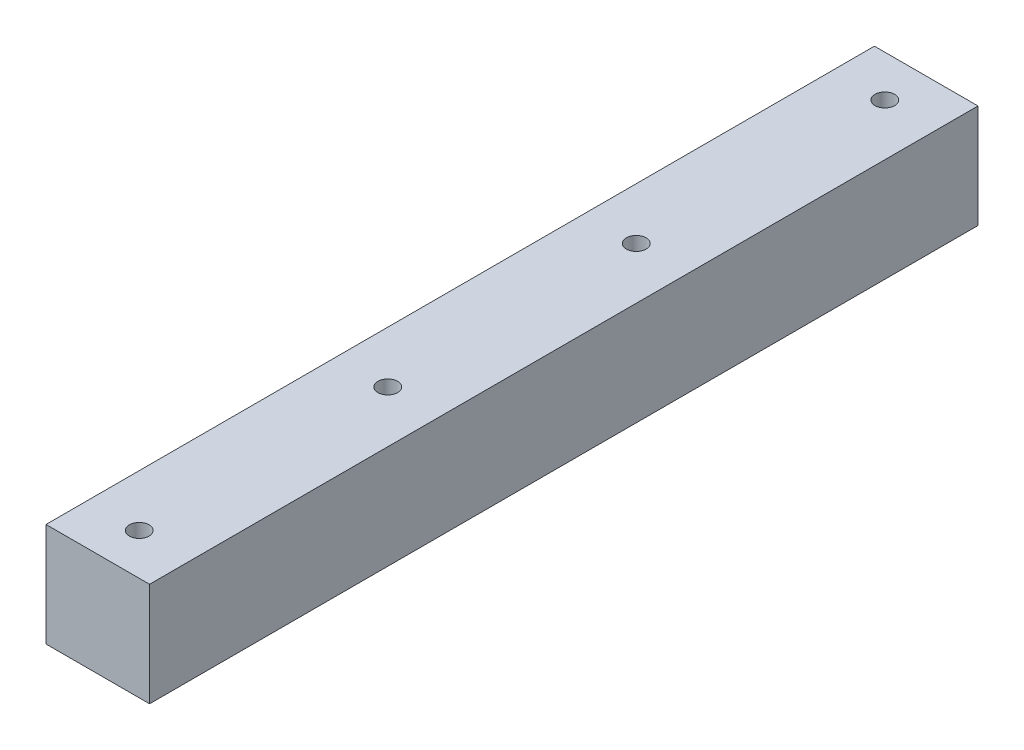
ISO-10303-21;
HEADER;
FILE_DESCRIPTION(('STEP AP214'),'2;1');
FILE_NAME('part.step','',(''),(''),'','','');
FILE_SCHEMA(('AUTOMOTIVE_DESIGN { 1 0 10303 214 1 1 1 1 }'));
ENDSEC;
DATA;
#1=APPLICATION_CONTEXT('core data for automotive mechanical design processes');
#2=APPLICATION_PROTOCOL_DEFINITION('international standard','automotive_design',2000,#1);
#3=PRODUCT_CONTEXT('',#1,'mechanical');
#4=PRODUCT('Part','Part','',(#3));
#5=PRODUCT_RELATED_PRODUCT_CATEGORY('part','',(#4));
#6=PRODUCT_DEFINITION_FORMATION('','',#4);
#7=PRODUCT_DEFINITION_CONTEXT('part definition',#1,'design');
#8=PRODUCT_DEFINITION('design','',#6,#7);
#9=PRODUCT_DEFINITION_SHAPE('','',#8);
#10=(LENGTH_UNIT() NAMED_UNIT(*) SI_UNIT(.MILLI.,.METRE.));
#11=(NAMED_UNIT(*) PLANE_ANGLE_UNIT() SI_UNIT($,.RADIAN.));
#12=(NAMED_UNIT(*) SI_UNIT($,.STERADIAN.) SOLID_ANGLE_UNIT());
#13=UNCERTAINTY_MEASURE_WITH_UNIT(LENGTH_MEASURE(1.E-05),#10,'distance_accuracy_value','');
#14=(GEOMETRIC_REPRESENTATION_CONTEXT(3) GLOBAL_UNCERTAINTY_ASSIGNED_CONTEXT((#13)) GLOBAL_UNIT_ASSIGNED_CONTEXT((#10,
#11,#12)) REPRESENTATION_CONTEXT('',''));
#15=CARTESIAN_POINT('',(0.,0.,0.));
#16=DIRECTION('',(0.,0.,1.));
#17=DIRECTION('',(1.,0.,0.));
#18=AXIS2_PLACEMENT_3D('',#15,#16,#17);
#19=CARTESIAN_POINT('',(25.,50.,200.));
#20=DIRECTION('',(-1.,0.,0.));
#21=DIRECTION('',(0.,0.,1.));
#22=AXIS2_PLACEMENT_3D('',#19,#20,#21);
#23=PLANE('',#22);
#24=DIRECTION('',(0.,0.,-1.));
#25=VECTOR('',#24,1.);
#26=CARTESIAN_POINT('',(25.,0.,200.));
#27=LINE('',#26,#25);
#28=CARTESIAN_POINT('',(25.,0.,200.));
#29=VERTEX_POINT('',#28);
#30=CARTESIAN_POINT('',(25.,0.,-200.));
#31=VERTEX_POINT('',#30);
#32=EDGE_CURVE('E101',#29,#31,#27,.T.);
#33=ORIENTED_EDGE('',*,*,#32,.T.);
#34=DIRECTION('',(0.,-1.,0.));
#35=VECTOR('',#34,1.);
#36=CARTESIAN_POINT('',(25.,50.,-200.));
#37=LINE('',#36,#35);
#38=CARTESIAN_POINT('',(25.,50.,-200.));
#39=VERTEX_POINT('',#38);
#40=EDGE_CURVE('E128',#39,#31,#37,.T.);
#41=ORIENTED_EDGE('',*,*,#40,.F.);
#42=DIRECTION('',(0.,0.,-1.));
#43=VECTOR('',#42,1.);
#44=CARTESIAN_POINT('',(25.,50.,200.));
#45=LINE('',#44,#43);
#46=CARTESIAN_POINT('',(25.,50.,200.));
#47=VERTEX_POINT('',#46);
#48=EDGE_CURVE('E102',#47,#39,#45,.T.);
#49=ORIENTED_EDGE('',*,*,#48,.F.);
#50=DIRECTION('',(0.,-1.,0.));
#51=VECTOR('',#50,1.);
#52=CARTESIAN_POINT('',(25.,50.,200.));
#53=LINE('',#52,#51);
#54=EDGE_CURVE('E112',#47,#29,#53,.T.);
#55=ORIENTED_EDGE('',*,*,#54,.T.);
#56=EDGE_LOOP('',(#33,#41,#49,#55));
#57=FACE_BOUND('',#56,.T.);
#58=ADVANCED_FACE('F35',(#57),#23,.F.);
#59=CARTESIAN_POINT('',(-25.,50.,-200.));
#60=DIRECTION('',(0.,0.,1.));
#61=DIRECTION('',(1.,0.,0.));
#62=AXIS2_PLACEMENT_3D('',#59,#60,#61);
#63=PLANE('',#62);
#64=DIRECTION('',(-1.,0.,0.));
#65=VECTOR('',#64,1.);
#66=CARTESIAN_POINT('',(-25.,0.,-200.));
#67=LINE('',#66,#65);
#68=CARTESIAN_POINT('',(-25.,0.,-200.));
#69=VERTEX_POINT('',#68);
#70=EDGE_CURVE('E115',#31,#69,#67,.T.);
#71=ORIENTED_EDGE('',*,*,#70,.T.);
#72=DIRECTION('',(0.,-1.,0.));
#73=VECTOR('',#72,1.);
#74=CARTESIAN_POINT('',(-25.,50.,-200.));
#75=LINE('',#74,#73);
#76=CARTESIAN_POINT('',(-25.,50.,-200.));
#77=VERTEX_POINT('',#76);
#78=EDGE_CURVE('E125',#77,#69,#75,.T.);
#79=ORIENTED_EDGE('',*,*,#78,.F.);
#80=DIRECTION('',(-1.,0.,0.));
#81=VECTOR('',#80,1.);
#82=CARTESIAN_POINT('',(-25.,50.,-200.));
#83=LINE('',#82,#81);
#84=EDGE_CURVE('E105',#39,#77,#83,.T.);
#85=ORIENTED_EDGE('',*,*,#84,.F.);
#86=ORIENTED_EDGE('',*,*,#40,.T.);
#87=EDGE_LOOP('',(#71,#79,#85,#86));
#88=FACE_BOUND('',#87,.T.);
#89=ADVANCED_FACE('F160',(#88),#63,.F.);
#90=CARTESIAN_POINT('',(-25.,50.,200.));
#91=DIRECTION('',(1.,0.,0.));
#92=DIRECTION('',(0.,0.,-1.));
#93=AXIS2_PLACEMENT_3D('',#90,#91,#92);
#94=PLANE('',#93);
#95=DIRECTION('',(0.,0.,1.));
#96=VECTOR('',#95,1.);
#97=CARTESIAN_POINT('',(-25.,0.,200.));
#98=LINE('',#97,#96);
#99=CARTESIAN_POINT('',(-25.,0.,200.));
#100=VERTEX_POINT('',#99);
#101=EDGE_CURVE('E117',#69,#100,#98,.T.);
#102=ORIENTED_EDGE('',*,*,#101,.T.);
#103=DIRECTION('',(0.,-1.,0.));
#104=VECTOR('',#103,1.);
#105=CARTESIAN_POINT('',(-25.,50.,200.));
#106=LINE('',#105,#104);
#107=CARTESIAN_POINT('',(-25.,50.,200.));
#108=VERTEX_POINT('',#107);
#109=EDGE_CURVE('E122',#108,#100,#106,.T.);
#110=ORIENTED_EDGE('',*,*,#109,.F.);
#111=DIRECTION('',(0.,0.,1.));
#112=VECTOR('',#111,1.);
#113=CARTESIAN_POINT('',(-25.,50.,200.));
#114=LINE('',#113,#112);
#115=EDGE_CURVE('E108',#77,#108,#114,.T.);
#116=ORIENTED_EDGE('',*,*,#115,.F.);
#117=ORIENTED_EDGE('',*,*,#78,.T.);
#118=EDGE_LOOP('',(#102,#110,#116,#117));
#119=FACE_BOUND('',#118,.T.);
#120=ADVANCED_FACE('F153',(#119),#94,.F.);
#121=CARTESIAN_POINT('',(-25.,50.,200.));
#122=DIRECTION('',(0.,0.,-1.));
#123=DIRECTION('',(-1.,0.,0.));
#124=AXIS2_PLACEMENT_3D('',#121,#122,#123);
#125=PLANE('',#124);
#126=DIRECTION('',(1.,0.,0.));
#127=VECTOR('',#126,1.);
#128=CARTESIAN_POINT('',(-25.,0.,200.));
#129=LINE('',#128,#127);
#130=EDGE_CURVE('E106',#100,#29,#129,.T.);
#131=ORIENTED_EDGE('',*,*,#130,.T.);
#132=ORIENTED_EDGE('',*,*,#54,.F.);
#133=DIRECTION('',(1.,0.,0.));
#134=VECTOR('',#133,1.);
#135=CARTESIAN_POINT('',(-25.,50.,200.));
#136=LINE('',#135,#134);
#137=EDGE_CURVE('E110',#108,#47,#136,.T.);
#138=ORIENTED_EDGE('',*,*,#137,.F.);
#139=ORIENTED_EDGE('',*,*,#109,.T.);
#140=EDGE_LOOP('',(#131,#132,#138,#139));
#141=FACE_BOUND('',#140,.T.);
#142=ADVANCED_FACE('F143',(#141),#125,.F.);
#143=CARTESIAN_POINT('',(0.,50.,0.));
#144=DIRECTION('',(0.,-1.,0.));
#145=DIRECTION('',(0.,0.,-1.));
#146=AXIS2_PLACEMENT_3D('',#143,#144,#145);
#147=PLANE('',#146);
#148=CARTESIAN_POINT('',(0.,50.,59.9999999999999));
#149=DIRECTION('',(0.,1.,0.));
#150=DIRECTION('',(0.,0.,1.));
#151=AXIS2_PLACEMENT_3D('',#148,#149,#150);
#152=CIRCLE('',#151,4.75);
#153=CARTESIAN_POINT('',(0.,50.,64.7499999999999));
#154=VERTEX_POINT('',#153);
#155=EDGE_CURVE('E91',#154,#154,#152,.T.);
#156=ORIENTED_EDGE('',*,*,#155,.F.);
#157=EDGE_LOOP('',(#156));
#158=FACE_BOUND('',#157,.T.);
#159=CARTESIAN_POINT('',(0.,50.,180.));
#160=DIRECTION('',(0.,1.,0.));
#161=DIRECTION('',(0.,0.,1.));
#162=AXIS2_PLACEMENT_3D('',#159,#160,#161);
#163=CIRCLE('',#162,4.75);
#164=CARTESIAN_POINT('',(0.,50.,184.75));
#165=VERTEX_POINT('',#164);
#166=EDGE_CURVE('E90',#165,#165,#163,.T.);
#167=ORIENTED_EDGE('',*,*,#166,.F.);
#168=EDGE_LOOP('',(#167));
#169=FACE_BOUND('',#168,.T.);
#170=ORIENTED_EDGE('',*,*,#48,.T.);
#171=ORIENTED_EDGE('',*,*,#84,.T.);
#172=ORIENTED_EDGE('',*,*,#115,.T.);
#173=ORIENTED_EDGE('',*,*,#137,.T.);
#174=EDGE_LOOP('',(#170,#171,#172,#173));
#175=FACE_BOUND('',#174,.T.);
#176=CARTESIAN_POINT('',(0.,50.,-60.0000000000001));
#177=DIRECTION('',(0.,1.,0.));
#178=DIRECTION('',(0.,0.,1.));
#179=AXIS2_PLACEMENT_3D('',#176,#177,#178);
#180=CIRCLE('',#179,4.75);
#181=CARTESIAN_POINT('',(0.,50.,-55.2500000000001));
#182=VERTEX_POINT('',#181);
#183=EDGE_CURVE('E131',#182,#182,#180,.T.);
#184=ORIENTED_EDGE('',*,*,#183,.F.);
#185=EDGE_LOOP('',(#184));
#186=FACE_BOUND('',#185,.T.);
#187=CARTESIAN_POINT('',(0.,50.,-180.));
#188=DIRECTION('',(0.,1.,0.));
#189=DIRECTION('',(0.,0.,1.));
#190=AXIS2_PLACEMENT_3D('',#187,#188,#189);
#191=CIRCLE('',#190,4.75);
#192=CARTESIAN_POINT('',(0.,50.,-175.25));
#193=VERTEX_POINT('',#192);
#194=EDGE_CURVE('E43',#193,#193,#191,.T.);
#195=ORIENTED_EDGE('',*,*,#194,.F.);
#196=EDGE_LOOP('',(#195));
#197=FACE_BOUND('',#196,.T.);
#198=ADVANCED_FACE('F140',(#158,#169,#175,#186,#197),#147,.F.);
#199=CARTESIAN_POINT('',(0.,0.,0.));
#200=DIRECTION('',(0.,-1.,0.));
#201=DIRECTION('',(0.,0.,-1.));
#202=AXIS2_PLACEMENT_3D('',#199,#200,#201);
#203=PLANE('',#202);
#204=ORIENTED_EDGE('',*,*,#32,.F.);
#205=ORIENTED_EDGE('',*,*,#130,.F.);
#206=ORIENTED_EDGE('',*,*,#101,.F.);
#207=ORIENTED_EDGE('',*,*,#70,.F.);
#208=EDGE_LOOP('',(#204,#205,#206,#207));
#209=FACE_BOUND('',#208,.T.);
#210=ADVANCED_FACE('F142',(#209),#203,.T.);
#211=CARTESIAN_POINT('',(0.,30.,180.));
#212=DIRECTION('',(0.,1.,0.));
#213=DIRECTION('',(0.,0.,1.));
#214=AXIS2_PLACEMENT_3D('',#211,#212,#213);
#215=CONICAL_SURFACE('',#214,4.75,1.02974425867665);
#216=CARTESIAN_POINT('',(0.,27.1459120596191,180.));
#217=VERTEX_POINT('',#216);
#218=VERTEX_LOOP('',#217);
#219=FACE_BOUND('',#218,.T.);
#220=CARTESIAN_POINT('',(0.,30.,180.));
#221=DIRECTION('',(0.,1.,0.));
#222=DIRECTION('',(0.,0.,1.));
#223=AXIS2_PLACEMENT_3D('',#220,#221,#222);
#224=CIRCLE('',#223,4.75);
#225=CARTESIAN_POINT('',(0.,30.,184.75));
#226=VERTEX_POINT('',#225);
#227=EDGE_CURVE('E94',#226,#226,#224,.T.);
#228=ORIENTED_EDGE('',*,*,#227,.T.);
#229=EDGE_LOOP('',(#228));
#230=FACE_BOUND('',#229,.T.);
#231=ADVANCED_FACE('F150',(#219,#230),#215,.F.);
#232=CARTESIAN_POINT('',(0.,50.,180.));
#233=DIRECTION('',(0.,1.,0.));
#234=DIRECTION('',(0.,0.,1.));
#235=AXIS2_PLACEMENT_3D('',#232,#233,#234);
#236=CYLINDRICAL_SURFACE('',#235,4.75);
#237=ORIENTED_EDGE('',*,*,#227,.F.);
#238=EDGE_LOOP('',(#237));
#239=FACE_BOUND('',#238,.T.);
#240=ORIENTED_EDGE('',*,*,#166,.T.);
#241=EDGE_LOOP('',(#240));
#242=FACE_BOUND('',#241,.T.);
#243=ADVANCED_FACE('F84',(#239,#242),#236,.F.);
#244=CARTESIAN_POINT('',(0.,30.,59.9999999999999));
#245=DIRECTION('',(0.,1.,0.));
#246=DIRECTION('',(0.,0.,1.));
#247=AXIS2_PLACEMENT_3D('',#244,#245,#246);
#248=CONICAL_SURFACE('',#247,4.75,1.02974425867665);
#249=CARTESIAN_POINT('',(0.,27.1459120596191,59.9999999999999));
#250=VERTEX_POINT('',#249);
#251=VERTEX_LOOP('',#250);
#252=FACE_BOUND('',#251,.T.);
#253=CARTESIAN_POINT('',(0.,30.,59.9999999999999));
#254=DIRECTION('',(0.,1.,0.));
#255=DIRECTION('',(0.,0.,1.));
#256=AXIS2_PLACEMENT_3D('',#253,#254,#255);
#257=CIRCLE('',#256,4.75);
#258=CARTESIAN_POINT('',(0.,30.,64.7499999999999));
#259=VERTEX_POINT('',#258);
#260=EDGE_CURVE('E88',#259,#259,#257,.T.);
#261=ORIENTED_EDGE('',*,*,#260,.T.);
#262=EDGE_LOOP('',(#261));
#263=FACE_BOUND('',#262,.T.);
#264=ADVANCED_FACE('F80',(#252,#263),#248,.F.);
#265=CARTESIAN_POINT('',(0.,50.,59.9999999999999));
#266=DIRECTION('',(0.,1.,0.));
#267=DIRECTION('',(0.,0.,1.));
#268=AXIS2_PLACEMENT_3D('',#265,#266,#267);
#269=CYLINDRICAL_SURFACE('',#268,4.75);
#270=ORIENTED_EDGE('',*,*,#260,.F.);
#271=EDGE_LOOP('',(#270));
#272=FACE_BOUND('',#271,.T.);
#273=ORIENTED_EDGE('',*,*,#155,.T.);
#274=EDGE_LOOP('',(#273));
#275=FACE_BOUND('',#274,.T.);
#276=ADVANCED_FACE('F83',(#272,#275),#269,.F.);
#277=CARTESIAN_POINT('',(0.,50.,-60.0000000000001));
#278=DIRECTION('',(0.,1.,0.));
#279=DIRECTION('',(0.,0.,1.));
#280=AXIS2_PLACEMENT_3D('',#277,#278,#279);
#281=CYLINDRICAL_SURFACE('',#280,4.75);
#282=CARTESIAN_POINT('',(0.,30.,-60.0000000000001));
#283=DIRECTION('',(0.,1.,0.));
#284=DIRECTION('',(0.,0.,1.));
#285=AXIS2_PLACEMENT_3D('',#282,#283,#284);
#286=CIRCLE('',#285,4.75);
#287=CARTESIAN_POINT('',(0.,30.,-55.2500000000001));
#288=VERTEX_POINT('',#287);
#289=EDGE_CURVE('E134',#288,#288,#286,.T.);
#290=ORIENTED_EDGE('',*,*,#289,.F.);
#291=EDGE_LOOP('',(#290));
#292=FACE_BOUND('',#291,.T.);
#293=ORIENTED_EDGE('',*,*,#183,.T.);
#294=EDGE_LOOP('',(#293));
#295=FACE_BOUND('',#294,.T.);
#296=ADVANCED_FACE('F173',(#292,#295),#281,.F.);
#297=CARTESIAN_POINT('',(0.,30.,-60.0000000000001));
#298=DIRECTION('',(0.,1.,0.));
#299=DIRECTION('',(0.,0.,1.));
#300=AXIS2_PLACEMENT_3D('',#297,#298,#299);
#301=CONICAL_SURFACE('',#300,4.75,1.02974425867665);
#302=CARTESIAN_POINT('',(0.,27.1459120596191,-60.0000000000001));
#303=VERTEX_POINT('',#302);
#304=VERTEX_LOOP('',#303);
#305=FACE_BOUND('',#304,.T.);
#306=ORIENTED_EDGE('',*,*,#289,.T.);
#307=EDGE_LOOP('',(#306));
#308=FACE_BOUND('',#307,.T.);
#309=ADVANCED_FACE('F170',(#305,#308),#301,.F.);
#310=CARTESIAN_POINT('',(0.,50.,-180.));
#311=DIRECTION('',(0.,1.,0.));
#312=DIRECTION('',(0.,0.,1.));
#313=AXIS2_PLACEMENT_3D('',#310,#311,#312);
#314=CYLINDRICAL_SURFACE('',#313,4.75);
#315=CARTESIAN_POINT('',(0.,30.,-180.));
#316=DIRECTION('',(0.,1.,0.));
#317=DIRECTION('',(0.,0.,1.));
#318=AXIS2_PLACEMENT_3D('',#315,#316,#317);
#319=CIRCLE('',#318,4.75);
#320=CARTESIAN_POINT('',(0.,30.,-175.25));
#321=VERTEX_POINT('',#320);
#322=EDGE_CURVE('E11',#321,#321,#319,.T.);
#323=ORIENTED_EDGE('',*,*,#322,.F.);
#324=EDGE_LOOP('',(#323));
#325=FACE_BOUND('',#324,.T.);
#326=ORIENTED_EDGE('',*,*,#194,.T.);
#327=EDGE_LOOP('',(#326));
#328=FACE_BOUND('',#327,.T.);
#329=ADVANCED_FACE('F37',(#325,#328),#314,.F.);
#330=CARTESIAN_POINT('',(0.,30.,-180.));
#331=DIRECTION('',(0.,1.,0.));
#332=DIRECTION('',(0.,0.,1.));
#333=AXIS2_PLACEMENT_3D('',#330,#331,#332);
#334=CONICAL_SURFACE('',#333,4.75,1.02974425867665);
#335=CARTESIAN_POINT('',(0.,27.1459120596191,-180.));
#336=VERTEX_POINT('',#335);
#337=VERTEX_LOOP('',#336);
#338=FACE_BOUND('',#337,.T.);
#339=ORIENTED_EDGE('',*,*,#322,.T.);
#340=EDGE_LOOP('',(#339));
#341=FACE_BOUND('',#340,.T.);
#342=ADVANCED_FACE('F176',(#338,#341),#334,.F.);
#343=CLOSED_SHELL('',(#58,#89,#120,#142,#198,#210,#231,#243,#264,#276,#296,#309,#329,#342));
#344=MANIFOLD_SOLID_BREP('B2',#343);
#345=ADVANCED_BREP_SHAPE_REPRESENTATION('',(#18,#344),#14);
#346=SHAPE_DEFINITION_REPRESENTATION(#9,#345);
ENDSEC;
END-ISO-10303-21;
